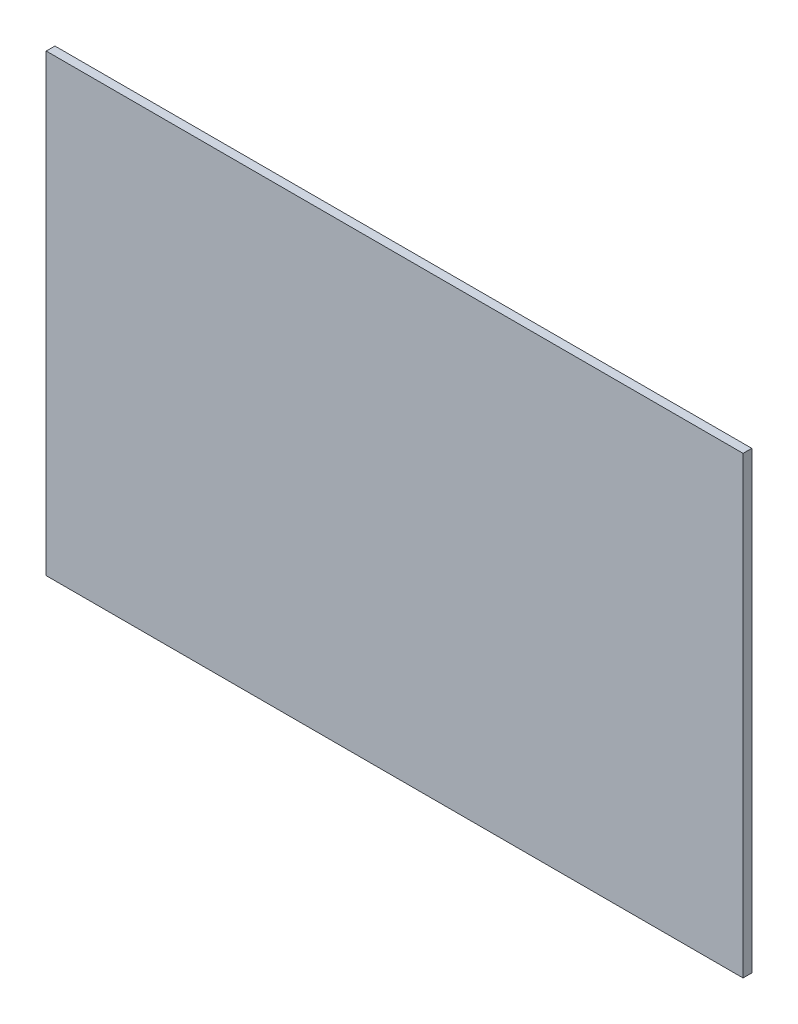
ISO-10303-21;
HEADER;
FILE_DESCRIPTION(('STEP AP214'),'2;1');
FILE_NAME('part.step','',(''),(''),'','','');
FILE_SCHEMA(('AUTOMOTIVE_DESIGN { 1 0 10303 214 1 1 1 1 }'));
ENDSEC;
DATA;
#1=APPLICATION_CONTEXT('core data for automotive mechanical design processes');
#2=APPLICATION_PROTOCOL_DEFINITION('international standard','automotive_design',2000,#1);
#3=PRODUCT_CONTEXT('',#1,'mechanical');
#4=PRODUCT('Part','Part','',(#3));
#5=PRODUCT_RELATED_PRODUCT_CATEGORY('part','',(#4));
#6=PRODUCT_DEFINITION_FORMATION('','',#4);
#7=PRODUCT_DEFINITION_CONTEXT('part definition',#1,'design');
#8=PRODUCT_DEFINITION('design','',#6,#7);
#9=PRODUCT_DEFINITION_SHAPE('','',#8);
#10=(LENGTH_UNIT() NAMED_UNIT(*) SI_UNIT(.MILLI.,.METRE.));
#11=(NAMED_UNIT(*) PLANE_ANGLE_UNIT() SI_UNIT($,.RADIAN.));
#12=(NAMED_UNIT(*) SI_UNIT($,.STERADIAN.) SOLID_ANGLE_UNIT());
#13=UNCERTAINTY_MEASURE_WITH_UNIT(LENGTH_MEASURE(1.E-05),#10,'distance_accuracy_value','');
#14=(GEOMETRIC_REPRESENTATION_CONTEXT(3) GLOBAL_UNCERTAINTY_ASSIGNED_CONTEXT((#13)) GLOBAL_UNIT_ASSIGNED_CONTEXT((#10,
#11,#12)) REPRESENTATION_CONTEXT('',''));
#15=CARTESIAN_POINT('',(0.,0.,0.));
#16=DIRECTION('',(0.,0.,1.));
#17=DIRECTION('',(1.,0.,0.));
#18=AXIS2_PLACEMENT_3D('',#15,#16,#17);
#19=CARTESIAN_POINT('',(0.,0.,5.));
#20=DIRECTION('',(1.,0.,0.));
#21=DIRECTION('',(0.,1.,0.));
#22=AXIS2_PLACEMENT_3D('',#19,#20,#21);
#23=PLANE('',#22);
#24=DIRECTION('',(0.,-1.,0.));
#25=VECTOR('',#24,1.);
#26=CARTESIAN_POINT('',(0.,0.,0.));
#27=LINE('',#26,#25);
#28=CARTESIAN_POINT('',(0.,0.,0.));
#29=VERTEX_POINT('',#28);
#30=CARTESIAN_POINT('',(0.,-260.8,0.));
#31=VERTEX_POINT('',#30);
#32=EDGE_CURVE('E93',#29,#31,#27,.T.);
#33=ORIENTED_EDGE('',*,*,#32,.T.);
#34=DIRECTION('',(0.,0.,-1.));
#35=VECTOR('',#34,1.);
#36=CARTESIAN_POINT('',(0.,-260.8,5.));
#37=LINE('',#36,#35);
#38=CARTESIAN_POINT('',(0.,-260.8,5.));
#39=VERTEX_POINT('',#38);
#40=EDGE_CURVE('E11',#39,#31,#37,.T.);
#41=ORIENTED_EDGE('',*,*,#40,.F.);
#42=DIRECTION('',(0.,-1.,0.));
#43=VECTOR('',#42,1.);
#44=CARTESIAN_POINT('',(0.,0.,5.));
#45=LINE('',#44,#43);
#46=CARTESIAN_POINT('',(0.,0.,5.));
#47=VERTEX_POINT('',#46);
#48=EDGE_CURVE('E81',#47,#39,#45,.T.);
#49=ORIENTED_EDGE('',*,*,#48,.F.);
#50=DIRECTION('',(0.,0.,-1.));
#51=VECTOR('',#50,1.);
#52=CARTESIAN_POINT('',(0.,0.,5.));
#53=LINE('',#52,#51);
#54=EDGE_CURVE('E89',#47,#29,#53,.T.);
#55=ORIENTED_EDGE('',*,*,#54,.T.);
#56=EDGE_LOOP('',(#33,#41,#49,#55));
#57=FACE_BOUND('',#56,.T.);
#58=ADVANCED_FACE('F30',(#57),#23,.F.);
#59=CARTESIAN_POINT('',(0.,-260.8,5.));
#60=DIRECTION('',(0.,1.,0.));
#61=DIRECTION('',(0.,0.,1.));
#62=AXIS2_PLACEMENT_3D('',#59,#60,#61);
#63=PLANE('',#62);
#64=DIRECTION('',(1.,0.,0.));
#65=VECTOR('',#64,1.);
#66=CARTESIAN_POINT('',(0.,-260.8,0.));
#67=LINE('',#66,#65);
#68=CARTESIAN_POINT('',(400.,-260.8,0.));
#69=VERTEX_POINT('',#68);
#70=EDGE_CURVE('E85',#31,#69,#67,.T.);
#71=ORIENTED_EDGE('',*,*,#70,.T.);
#72=DIRECTION('',(0.,0.,-1.));
#73=VECTOR('',#72,1.);
#74=CARTESIAN_POINT('',(400.,-260.8,5.));
#75=LINE('',#74,#73);
#76=CARTESIAN_POINT('',(400.,-260.8,5.));
#77=VERTEX_POINT('',#76);
#78=EDGE_CURVE('E38',#77,#69,#75,.T.);
#79=ORIENTED_EDGE('',*,*,#78,.F.);
#80=DIRECTION('',(1.,0.,0.));
#81=VECTOR('',#80,1.);
#82=CARTESIAN_POINT('',(0.,-260.8,5.));
#83=LINE('',#82,#81);
#84=EDGE_CURVE('E76',#39,#77,#83,.T.);
#85=ORIENTED_EDGE('',*,*,#84,.F.);
#86=ORIENTED_EDGE('',*,*,#40,.T.);
#87=EDGE_LOOP('',(#71,#79,#85,#86));
#88=FACE_BOUND('',#87,.T.);
#89=ADVANCED_FACE('F84',(#88),#63,.F.);
#90=CARTESIAN_POINT('',(400.,0.,5.));
#91=DIRECTION('',(-1.,0.,0.));
#92=DIRECTION('',(0.,-1.,0.));
#93=AXIS2_PLACEMENT_3D('',#90,#91,#92);
#94=PLANE('',#93);
#95=DIRECTION('',(0.,1.,0.));
#96=VECTOR('',#95,1.);
#97=CARTESIAN_POINT('',(400.,0.,0.));
#98=LINE('',#97,#96);
#99=CARTESIAN_POINT('',(400.,0.,0.));
#100=VERTEX_POINT('',#99);
#101=EDGE_CURVE('E63',#69,#100,#98,.T.);
#102=ORIENTED_EDGE('',*,*,#101,.T.);
#103=DIRECTION('',(0.,0.,-1.));
#104=VECTOR('',#103,1.);
#105=CARTESIAN_POINT('',(400.,0.,5.));
#106=LINE('',#105,#104);
#107=CARTESIAN_POINT('',(400.,0.,5.));
#108=VERTEX_POINT('',#107);
#109=EDGE_CURVE('E86',#108,#100,#106,.T.);
#110=ORIENTED_EDGE('',*,*,#109,.F.);
#111=DIRECTION('',(0.,1.,0.));
#112=VECTOR('',#111,1.);
#113=CARTESIAN_POINT('',(400.,0.,5.));
#114=LINE('',#113,#112);
#115=EDGE_CURVE('E79',#77,#108,#114,.T.);
#116=ORIENTED_EDGE('',*,*,#115,.F.);
#117=ORIENTED_EDGE('',*,*,#78,.T.);
#118=EDGE_LOOP('',(#102,#110,#116,#117));
#119=FACE_BOUND('',#118,.T.);
#120=ADVANCED_FACE('F87',(#119),#94,.F.);
#121=CARTESIAN_POINT('',(0.,0.,5.));
#122=DIRECTION('',(0.,-1.,0.));
#123=DIRECTION('',(0.,0.,-1.));
#124=AXIS2_PLACEMENT_3D('',#121,#122,#123);
#125=PLANE('',#124);
#126=DIRECTION('',(-1.,0.,0.));
#127=VECTOR('',#126,1.);
#128=CARTESIAN_POINT('',(0.,0.,0.));
#129=LINE('',#128,#127);
#130=EDGE_CURVE('E69',#100,#29,#129,.T.);
#131=ORIENTED_EDGE('',*,*,#130,.T.);
#132=ORIENTED_EDGE('',*,*,#54,.F.);
#133=DIRECTION('',(-1.,0.,0.));
#134=VECTOR('',#133,1.);
#135=CARTESIAN_POINT('',(0.,0.,5.));
#136=LINE('',#135,#134);
#137=EDGE_CURVE('E46',#108,#47,#136,.T.);
#138=ORIENTED_EDGE('',*,*,#137,.F.);
#139=ORIENTED_EDGE('',*,*,#109,.T.);
#140=EDGE_LOOP('',(#131,#132,#138,#139));
#141=FACE_BOUND('',#140,.T.);
#142=ADVANCED_FACE('F100',(#141),#125,.F.);
#143=CARTESIAN_POINT('',(0.,-260.8,5.));
#144=DIRECTION('',(0.,0.,1.));
#145=DIRECTION('',(1.,0.,0.));
#146=AXIS2_PLACEMENT_3D('',#143,#144,#145);
#147=PLANE('',#146);
#148=ORIENTED_EDGE('',*,*,#48,.T.);
#149=ORIENTED_EDGE('',*,*,#84,.T.);
#150=ORIENTED_EDGE('',*,*,#115,.T.);
#151=ORIENTED_EDGE('',*,*,#137,.T.);
#152=EDGE_LOOP('',(#148,#149,#150,#151));
#153=FACE_BOUND('',#152,.T.);
#154=ADVANCED_FACE('F77',(#153),#147,.T.);
#155=CARTESIAN_POINT('',(0.,-260.8,0.));
#156=DIRECTION('',(0.,0.,1.));
#157=DIRECTION('',(1.,0.,0.));
#158=AXIS2_PLACEMENT_3D('',#155,#156,#157);
#159=PLANE('',#158);
#160=ORIENTED_EDGE('',*,*,#32,.F.);
#161=ORIENTED_EDGE('',*,*,#130,.F.);
#162=ORIENTED_EDGE('',*,*,#101,.F.);
#163=ORIENTED_EDGE('',*,*,#70,.F.);
#164=EDGE_LOOP('',(#160,#161,#162,#163));
#165=FACE_BOUND('',#164,.T.);
#166=ADVANCED_FACE('F103',(#165),#159,.F.);
#167=CLOSED_SHELL('',(#58,#89,#120,#142,#154,#166));
#168=MANIFOLD_SOLID_BREP('B2',#167);
#169=ADVANCED_BREP_SHAPE_REPRESENTATION('',(#18,#168),#14);
#170=SHAPE_DEFINITION_REPRESENTATION(#9,#169);
ENDSEC;
END-ISO-10303-21;
